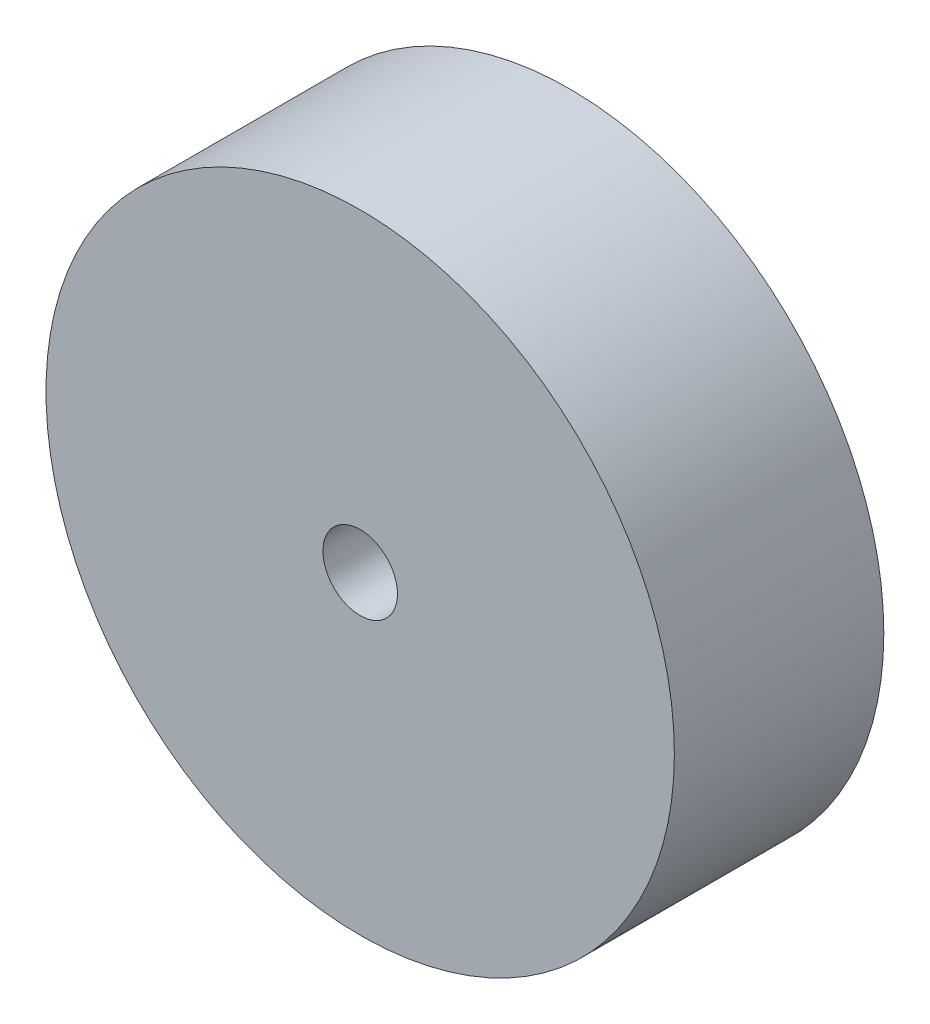
ISO-10303-21;
HEADER;
FILE_DESCRIPTION(('STEP AP214'),'2;1');
FILE_NAME('part.step','',(''),(''),'','','');
FILE_SCHEMA(('AUTOMOTIVE_DESIGN { 1 0 10303 214 1 1 1 1 }'));
ENDSEC;
DATA;
#1=APPLICATION_CONTEXT('core data for automotive mechanical design processes');
#2=APPLICATION_PROTOCOL_DEFINITION('international standard','automotive_design',2000,#1);
#3=PRODUCT_CONTEXT('',#1,'mechanical');
#4=PRODUCT('Part','Part','',(#3));
#5=PRODUCT_RELATED_PRODUCT_CATEGORY('part','',(#4));
#6=PRODUCT_DEFINITION_FORMATION('','',#4);
#7=PRODUCT_DEFINITION_CONTEXT('part definition',#1,'design');
#8=PRODUCT_DEFINITION('design','',#6,#7);
#9=PRODUCT_DEFINITION_SHAPE('','',#8);
#10=(LENGTH_UNIT() NAMED_UNIT(*) SI_UNIT(.MILLI.,.METRE.));
#11=(NAMED_UNIT(*) PLANE_ANGLE_UNIT() SI_UNIT($,.RADIAN.));
#12=(NAMED_UNIT(*) SI_UNIT($,.STERADIAN.) SOLID_ANGLE_UNIT());
#13=UNCERTAINTY_MEASURE_WITH_UNIT(LENGTH_MEASURE(1.E-05),#10,'distance_accuracy_value','');
#14=(GEOMETRIC_REPRESENTATION_CONTEXT(3) GLOBAL_UNCERTAINTY_ASSIGNED_CONTEXT((#13)) GLOBAL_UNIT_ASSIGNED_CONTEXT((#10,
#11,#12)) REPRESENTATION_CONTEXT('',''));
#15=CARTESIAN_POINT('',(0.,0.,0.));
#16=DIRECTION('',(0.,0.,1.));
#17=DIRECTION('',(1.,0.,0.));
#18=AXIS2_PLACEMENT_3D('',#15,#16,#17);
#19=CARTESIAN_POINT('',(0.,0.,6.35));
#20=DIRECTION('',(0.,0.,-1.));
#21=DIRECTION('',(-1.,0.,0.));
#22=AXIS2_PLACEMENT_3D('',#19,#20,#21);
#23=CYLINDRICAL_SURFACE('',#22,9.525);
#24=CARTESIAN_POINT('',(0.,0.,6.35));
#25=DIRECTION('',(0.,0.,1.));
#26=DIRECTION('',(1.,0.,0.));
#27=AXIS2_PLACEMENT_3D('',#24,#25,#26);
#28=CIRCLE('',#27,9.525);
#29=CARTESIAN_POINT('',(9.525,0.,6.35));
#30=VERTEX_POINT('',#29);
#31=EDGE_CURVE('E10',#30,#30,#28,.T.);
#32=ORIENTED_EDGE('',*,*,#31,.F.);
#33=EDGE_LOOP('',(#32));
#34=FACE_BOUND('',#33,.T.);
#35=CARTESIAN_POINT('',(0.,0.,0.));
#36=DIRECTION('',(0.,0.,1.));
#37=DIRECTION('',(1.,0.,0.));
#38=AXIS2_PLACEMENT_3D('',#35,#36,#37);
#39=CIRCLE('',#38,9.525);
#40=CARTESIAN_POINT('',(9.525,0.,0.));
#41=VERTEX_POINT('',#40);
#42=EDGE_CURVE('E36',#41,#41,#39,.T.);
#43=ORIENTED_EDGE('',*,*,#42,.T.);
#44=EDGE_LOOP('',(#43));
#45=FACE_BOUND('',#44,.T.);
#46=ADVANCED_FACE('F33',(#34,#45),#23,.T.);
#47=CARTESIAN_POINT('',(0.,0.,6.35));
#48=DIRECTION('',(0.,0.,1.));
#49=DIRECTION('',(1.,0.,0.));
#50=AXIS2_PLACEMENT_3D('',#47,#48,#49);
#51=PLANE('',#50);
#52=CARTESIAN_POINT('',(0.,0.,6.35));
#53=DIRECTION('',(0.,0.,1.));
#54=DIRECTION('',(1.,0.,0.));
#55=AXIS2_PLACEMENT_3D('',#52,#53,#54);
#56=CIRCLE('',#55,1.13029999999999);
#57=CARTESIAN_POINT('',(1.13029999999999,0.,6.35));
#58=VERTEX_POINT('',#57);
#59=EDGE_CURVE('E47',#58,#58,#56,.T.);
#60=ORIENTED_EDGE('',*,*,#59,.F.);
#61=EDGE_LOOP('',(#60));
#62=FACE_BOUND('',#61,.T.);
#63=ORIENTED_EDGE('',*,*,#31,.T.);
#64=EDGE_LOOP('',(#63));
#65=FACE_BOUND('',#64,.T.);
#66=ADVANCED_FACE('F53',(#62,#65),#51,.T.);
#67=CARTESIAN_POINT('',(0.,0.,0.));
#68=DIRECTION('',(0.,0.,1.));
#69=DIRECTION('',(1.,0.,0.));
#70=AXIS2_PLACEMENT_3D('',#67,#68,#69);
#71=PLANE('',#70);
#72=CARTESIAN_POINT('',(0.,0.,0.));
#73=DIRECTION('',(0.,0.,1.));
#74=DIRECTION('',(1.,0.,0.));
#75=AXIS2_PLACEMENT_3D('',#72,#73,#74);
#76=CIRCLE('',#75,1.1303);
#77=CARTESIAN_POINT('',(1.1303,0.,0.));
#78=VERTEX_POINT('',#77);
#79=EDGE_CURVE('E43',#78,#78,#76,.T.);
#80=ORIENTED_EDGE('',*,*,#79,.T.);
#81=EDGE_LOOP('',(#80));
#82=FACE_BOUND('',#81,.T.);
#83=ORIENTED_EDGE('',*,*,#42,.F.);
#84=EDGE_LOOP('',(#83));
#85=FACE_BOUND('',#84,.T.);
#86=ADVANCED_FACE('F55',(#82,#85),#71,.F.);
#87=CARTESIAN_POINT('',(0.,0.,6.35));
#88=DIRECTION('',(0.,0.,1.));
#89=DIRECTION('',(1.,0.,0.));
#90=AXIS2_PLACEMENT_3D('',#87,#88,#89);
#91=CYLINDRICAL_SURFACE('',#90,1.13029999999999);
#92=ORIENTED_EDGE('',*,*,#79,.F.);
#93=EDGE_LOOP('',(#92));
#94=FACE_BOUND('',#93,.T.);
#95=ORIENTED_EDGE('',*,*,#59,.T.);
#96=EDGE_LOOP('',(#95));
#97=FACE_BOUND('',#96,.T.);
#98=ADVANCED_FACE('F51',(#94,#97),#91,.F.);
#99=CLOSED_SHELL('',(#46,#66,#86,#98));
#100=MANIFOLD_SOLID_BREP('B2',#99);
#101=ADVANCED_BREP_SHAPE_REPRESENTATION('',(#18,#100),#14);
#102=SHAPE_DEFINITION_REPRESENTATION(#9,#101);
ENDSEC;
END-ISO-10303-21;
